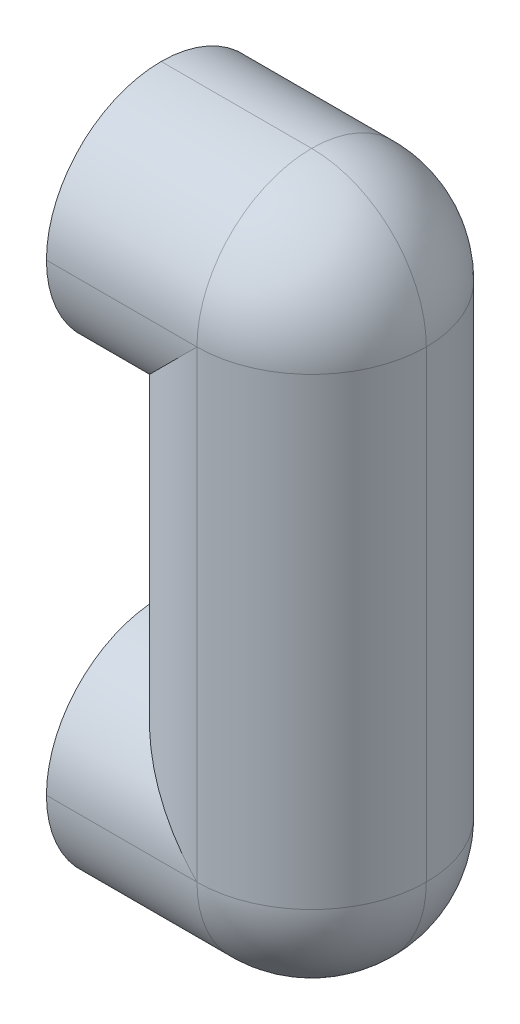
ISO-10303-21;
HEADER;
FILE_DESCRIPTION(('STEP AP214'),'2;1');
FILE_NAME('part.step','',(''),(''),'','','');
FILE_SCHEMA(('AUTOMOTIVE_DESIGN { 1 0 10303 214 1 1 1 1 }'));
ENDSEC;
DATA;
#1=APPLICATION_CONTEXT('core data for automotive mechanical design processes');
#2=APPLICATION_PROTOCOL_DEFINITION('international standard','automotive_design',2000,#1);
#3=PRODUCT_CONTEXT('',#1,'mechanical');
#4=PRODUCT('Part','Part','',(#3));
#5=PRODUCT_RELATED_PRODUCT_CATEGORY('part','',(#4));
#6=PRODUCT_DEFINITION_FORMATION('','',#4);
#7=PRODUCT_DEFINITION_CONTEXT('part definition',#1,'design');
#8=PRODUCT_DEFINITION('design','',#6,#7);
#9=PRODUCT_DEFINITION_SHAPE('','',#8);
#10=(LENGTH_UNIT() NAMED_UNIT(*) SI_UNIT(.MILLI.,.METRE.));
#11=(NAMED_UNIT(*) PLANE_ANGLE_UNIT() SI_UNIT($,.RADIAN.));
#12=(NAMED_UNIT(*) SI_UNIT($,.STERADIAN.) SOLID_ANGLE_UNIT());
#13=UNCERTAINTY_MEASURE_WITH_UNIT(LENGTH_MEASURE(1.E-05),#10,'distance_accuracy_value','');
#14=(GEOMETRIC_REPRESENTATION_CONTEXT(3) GLOBAL_UNCERTAINTY_ASSIGNED_CONTEXT((#13)) GLOBAL_UNIT_ASSIGNED_CONTEXT((#10,
#11,#12)) REPRESENTATION_CONTEXT('',''));
#15=CARTESIAN_POINT('',(0.,0.,0.));
#16=DIRECTION('',(0.,0.,1.));
#17=DIRECTION('',(1.,0.,0.));
#18=AXIS2_PLACEMENT_3D('',#15,#16,#17);
#19=CARTESIAN_POINT('',(-7.5,0.,0.));
#20=DIRECTION('',(-1.,0.,0.));
#21=DIRECTION('',(0.,0.,1.));
#22=AXIS2_PLACEMENT_3D('',#19,#20,#21);
#23=PLANE('',#22);
#24=CARTESIAN_POINT('',(-7.50000000000001,48.5,-24.));
#25=DIRECTION('',(-1.,0.,0.));
#26=DIRECTION('',(0.,0.,1.));
#27=AXIS2_PLACEMENT_3D('',#24,#25,#26);
#28=CIRCLE('',#27,5.);
#29=CARTESIAN_POINT('',(-7.50000000000001,48.5,-19.));
#30=VERTEX_POINT('',#29);
#31=EDGE_CURVE('E41',#30,#30,#28,.F.);
#32=ORIENTED_EDGE('',*,*,#31,.T.);
#33=EDGE_LOOP('',(#32));
#34=FACE_BOUND('',#33,.T.);
#35=CARTESIAN_POINT('',(-7.50000000000001,48.5,-24.));
#36=DIRECTION('',(-1.,0.,0.));
#37=DIRECTION('',(0.,0.,1.));
#38=AXIS2_PLACEMENT_3D('',#35,#36,#37);
#39=CIRCLE('',#38,24.);
#40=CARTESIAN_POINT('',(-7.50000000000001,48.5,-48.));
#41=VERTEX_POINT('',#40);
#42=CARTESIAN_POINT('',(-7.50000000000001,24.5,-24.));
#43=VERTEX_POINT('',#42);
#44=EDGE_CURVE('E47',#41,#43,#39,.T.);
#45=ORIENTED_EDGE('',*,*,#44,.T.);
#46=CARTESIAN_POINT('',(-7.50000000000001,48.5,-24.));
#47=DIRECTION('',(-1.,0.,0.));
#48=DIRECTION('',(0.,0.,1.));
#49=AXIS2_PLACEMENT_3D('',#46,#47,#48);
#50=CIRCLE('',#49,24.);
#51=CARTESIAN_POINT('',(-7.5,48.5,0.));
#52=VERTEX_POINT('',#51);
#53=EDGE_CURVE('E11',#43,#52,#50,.T.);
#54=ORIENTED_EDGE('',*,*,#53,.T.);
#55=CARTESIAN_POINT('',(-7.50000000000001,48.5,-24.));
#56=DIRECTION('',(-1.,0.,0.));
#57=DIRECTION('',(0.,0.,1.));
#58=AXIS2_PLACEMENT_3D('',#55,#56,#57);
#59=CIRCLE('',#58,24.);
#60=CARTESIAN_POINT('',(-7.50000000000001,72.5,-24.));
#61=VERTEX_POINT('',#60);
#62=EDGE_CURVE('E55',#52,#61,#59,.T.);
#63=ORIENTED_EDGE('',*,*,#62,.T.);
#64=CARTESIAN_POINT('',(-7.50000000000001,48.5,-24.));
#65=DIRECTION('',(-1.,0.,0.));
#66=DIRECTION('',(0.,0.,1.));
#67=AXIS2_PLACEMENT_3D('',#64,#65,#66);
#68=CIRCLE('',#67,24.);
#69=EDGE_CURVE('E119',#61,#41,#68,.T.);
#70=ORIENTED_EDGE('',*,*,#69,.T.);
#71=EDGE_LOOP('',(#45,#54,#63,#70));
#72=FACE_BOUND('',#71,.T.);
#73=ADVANCED_FACE('F37',(#34,#72),#23,.T.);
#74=CARTESIAN_POINT('',(-7.5,0.,0.));
#75=DIRECTION('',(1.,0.,0.));
#76=DIRECTION('',(0.,0.,-1.));
#77=AXIS2_PLACEMENT_3D('',#74,#75,#76);
#78=PLANE('',#77);
#79=CARTESIAN_POINT('',(-7.50000000000001,-48.5,-24.));
#80=DIRECTION('',(-1.,0.,0.));
#81=DIRECTION('',(0.,0.,1.));
#82=AXIS2_PLACEMENT_3D('',#79,#80,#81);
#83=CIRCLE('',#82,5.);
#84=CARTESIAN_POINT('',(-7.50000000000001,-48.5,-19.));
#85=VERTEX_POINT('',#84);
#86=EDGE_CURVE('E148',#85,#85,#83,.T.);
#87=ORIENTED_EDGE('',*,*,#86,.F.);
#88=EDGE_LOOP('',(#87));
#89=FACE_BOUND('',#88,.T.);
#90=CARTESIAN_POINT('',(-7.50000000000001,-48.5,-24.));
#91=DIRECTION('',(1.,0.,0.));
#92=DIRECTION('',(0.,0.,-1.));
#93=AXIS2_PLACEMENT_3D('',#90,#91,#92);
#94=CIRCLE('',#93,24.);
#95=CARTESIAN_POINT('',(-7.50000000000001,-72.5,-24.));
#96=VERTEX_POINT('',#95);
#97=CARTESIAN_POINT('',(-7.5,-48.5,0.));
#98=VERTEX_POINT('',#97);
#99=EDGE_CURVE('E140',#96,#98,#94,.F.);
#100=ORIENTED_EDGE('',*,*,#99,.T.);
#101=CARTESIAN_POINT('',(-7.50000000000001,-48.5,-24.));
#102=DIRECTION('',(1.,0.,0.));
#103=DIRECTION('',(0.,0.,-1.));
#104=AXIS2_PLACEMENT_3D('',#101,#102,#103);
#105=CIRCLE('',#104,24.);
#106=CARTESIAN_POINT('',(-7.50000000000001,-24.5,-24.));
#107=VERTEX_POINT('',#106);
#108=EDGE_CURVE('E152',#98,#107,#105,.F.);
#109=ORIENTED_EDGE('',*,*,#108,.T.);
#110=CARTESIAN_POINT('',(-7.50000000000001,-48.5,-24.));
#111=DIRECTION('',(1.,0.,0.));
#112=DIRECTION('',(0.,0.,-1.));
#113=AXIS2_PLACEMENT_3D('',#110,#111,#112);
#114=CIRCLE('',#113,24.);
#115=CARTESIAN_POINT('',(-7.50000000000001,-48.5,-48.));
#116=VERTEX_POINT('',#115);
#117=EDGE_CURVE('E106',#107,#116,#114,.F.);
#118=ORIENTED_EDGE('',*,*,#117,.T.);
#119=CARTESIAN_POINT('',(-7.50000000000001,-48.5,-24.));
#120=DIRECTION('',(1.,0.,0.));
#121=DIRECTION('',(0.,0.,-1.));
#122=AXIS2_PLACEMENT_3D('',#119,#120,#121);
#123=CIRCLE('',#122,24.);
#124=EDGE_CURVE('E142',#116,#96,#123,.F.);
#125=ORIENTED_EDGE('',*,*,#124,.T.);
#126=EDGE_LOOP('',(#100,#109,#118,#125));
#127=FACE_BOUND('',#126,.T.);
#128=ADVANCED_FACE('F238',(#89,#127),#78,.F.);
#129=CARTESIAN_POINT('',(0.,48.5,-24.));
#130=DIRECTION('',(1.,0.,0.));
#131=DIRECTION('',(0.,0.,-1.));
#132=AXIS2_PLACEMENT_3D('',#129,#130,#131);
#133=CYLINDRICAL_SURFACE('',#132,24.);
#134=DIRECTION('',(1.,0.,0.));
#135=VECTOR('',#134,1.);
#136=CARTESIAN_POINT('',(0.,48.5,0.));
#137=LINE('',#136,#135);
#138=CARTESIAN_POINT('',(24.,48.5,0.));
#139=VERTEX_POINT('',#138);
#140=EDGE_CURVE('E124',#52,#139,#137,.T.);
#141=ORIENTED_EDGE('',*,*,#140,.F.);
#142=ORIENTED_EDGE('',*,*,#53,.F.);
#143=DIRECTION('',(1.,0.,0.));
#144=VECTOR('',#143,1.);
#145=CARTESIAN_POINT('',(-7.50000000000001,24.5,-24.));
#146=LINE('',#145,#144);
#147=CARTESIAN_POINT('',(0.,24.5,-24.));
#148=VERTEX_POINT('',#147);
#149=EDGE_CURVE('E90',#148,#43,#146,.F.);
#150=ORIENTED_EDGE('',*,*,#149,.F.);
#151=CARTESIAN_POINT('',(24.,48.5,-24.));
#152=DIRECTION('',(0.707106781186547,-0.707106781186547,0.));
#153=DIRECTION('',(0.707106781186547,0.707106781186547,0.));
#154=AXIS2_PLACEMENT_3D('',#151,#152,#153);
#155=ELLIPSE('',#154,33.9411254969543,24.);
#156=EDGE_CURVE('E135',#139,#148,#155,.T.);
#157=ORIENTED_EDGE('',*,*,#156,.F.);
#158=EDGE_LOOP('',(#141,#142,#150,#157));
#159=FACE_BOUND('',#158,.T.);
#160=ADVANCED_FACE('F39',(#159),#133,.T.);
#161=CARTESIAN_POINT('',(0.,48.5,-24.));
#162=DIRECTION('',(1.,0.,0.));
#163=DIRECTION('',(0.,0.,-1.));
#164=AXIS2_PLACEMENT_3D('',#161,#162,#163);
#165=CYLINDRICAL_SURFACE('',#164,24.);
#166=CARTESIAN_POINT('',(24.,48.5,-24.));
#167=DIRECTION('',(1.,0.,0.));
#168=DIRECTION('',(0.,0.,-1.));
#169=AXIS2_PLACEMENT_3D('',#166,#167,#168);
#170=CIRCLE('',#169,24.);
#171=CARTESIAN_POINT('',(24.,72.5,-24.));
#172=VERTEX_POINT('',#171);
#173=EDGE_CURVE('E207',#172,#139,#170,.T.);
#174=ORIENTED_EDGE('',*,*,#173,.F.);
#175=DIRECTION('',(1.,0.,0.));
#176=VECTOR('',#175,1.);
#177=CARTESIAN_POINT('',(0.,72.5,-24.));
#178=LINE('',#177,#176);
#179=EDGE_CURVE('E133',#61,#172,#178,.T.);
#180=ORIENTED_EDGE('',*,*,#179,.F.);
#181=ORIENTED_EDGE('',*,*,#62,.F.);
#182=ORIENTED_EDGE('',*,*,#140,.T.);
#183=EDGE_LOOP('',(#174,#180,#181,#182));
#184=FACE_BOUND('',#183,.T.);
#185=ADVANCED_FACE('F215',(#184),#165,.T.);
#186=CARTESIAN_POINT('',(0.,48.5,-24.));
#187=DIRECTION('',(-1.,0.,0.));
#188=DIRECTION('',(0.,0.,1.));
#189=AXIS2_PLACEMENT_3D('',#186,#187,#188);
#190=CYLINDRICAL_SURFACE('',#189,24.);
#191=DIRECTION('',(-1.,0.,0.));
#192=VECTOR('',#191,1.);
#193=CARTESIAN_POINT('',(0.,48.5,-48.));
#194=LINE('',#193,#192);
#195=CARTESIAN_POINT('',(24.,48.5,-48.));
#196=VERTEX_POINT('',#195);
#197=EDGE_CURVE('E130',#41,#196,#194,.F.);
#198=ORIENTED_EDGE('',*,*,#197,.F.);
#199=ORIENTED_EDGE('',*,*,#69,.F.);
#200=ORIENTED_EDGE('',*,*,#179,.T.);
#201=CARTESIAN_POINT('',(24.,48.5,-24.));
#202=DIRECTION('',(1.,0.,0.));
#203=DIRECTION('',(0.,0.,-1.));
#204=AXIS2_PLACEMENT_3D('',#201,#202,#203);
#205=CIRCLE('',#204,24.);
#206=EDGE_CURVE('E203',#196,#172,#205,.T.);
#207=ORIENTED_EDGE('',*,*,#206,.F.);
#208=EDGE_LOOP('',(#198,#199,#200,#207));
#209=FACE_BOUND('',#208,.T.);
#210=ADVANCED_FACE('F218',(#209),#190,.T.);
#211=CARTESIAN_POINT('',(-7.50000000000001,-48.5,-24.));
#212=DIRECTION('',(1.,0.,0.));
#213=DIRECTION('',(0.,0.,-1.));
#214=AXIS2_PLACEMENT_3D('',#211,#212,#213);
#215=CYLINDRICAL_SURFACE('',#214,24.);
#216=CARTESIAN_POINT('',(24.,-48.5,-24.));
#217=DIRECTION('',(0.707106781186547,0.707106781186547,0.));
#218=DIRECTION('',(0.707106781186547,-0.707106781186547,0.));
#219=AXIS2_PLACEMENT_3D('',#216,#217,#218);
#220=ELLIPSE('',#219,33.9411254969543,24.);
#221=CARTESIAN_POINT('',(0.,-24.5,-24.));
#222=VERTEX_POINT('',#221);
#223=CARTESIAN_POINT('',(24.,-48.5,0.));
#224=VERTEX_POINT('',#223);
#225=EDGE_CURVE('E131',#222,#224,#220,.T.);
#226=ORIENTED_EDGE('',*,*,#225,.F.);
#227=DIRECTION('',(1.,0.,0.));
#228=VECTOR('',#227,1.);
#229=CARTESIAN_POINT('',(-7.50000000000001,-24.5,-24.));
#230=LINE('',#229,#228);
#231=EDGE_CURVE('E195',#107,#222,#230,.T.);
#232=ORIENTED_EDGE('',*,*,#231,.F.);
#233=ORIENTED_EDGE('',*,*,#108,.F.);
#234=DIRECTION('',(1.,0.,0.));
#235=VECTOR('',#234,1.);
#236=CARTESIAN_POINT('',(0.,-48.5,0.));
#237=LINE('',#236,#235);
#238=EDGE_CURVE('E192',#224,#98,#237,.F.);
#239=ORIENTED_EDGE('',*,*,#238,.F.);
#240=EDGE_LOOP('',(#226,#232,#233,#239));
#241=FACE_BOUND('',#240,.T.);
#242=ADVANCED_FACE('F236',(#241),#215,.T.);
#243=CARTESIAN_POINT('',(-7.50000000000001,48.5,-24.));
#244=DIRECTION('',(1.,0.,0.));
#245=DIRECTION('',(0.,0.,-1.));
#246=AXIS2_PLACEMENT_3D('',#243,#244,#245);
#247=CYLINDRICAL_SURFACE('',#246,24.);
#248=ORIENTED_EDGE('',*,*,#44,.F.);
#249=ORIENTED_EDGE('',*,*,#197,.T.);
#250=CARTESIAN_POINT('',(24.,48.5,-24.));
#251=DIRECTION('',(0.707106781186547,-0.707106781186547,0.));
#252=DIRECTION('',(-0.707106781186547,-0.707106781186547,0.));
#253=AXIS2_PLACEMENT_3D('',#250,#251,#252);
#254=ELLIPSE('',#253,33.9411254969543,24.);
#255=EDGE_CURVE('E128',#148,#196,#254,.T.);
#256=ORIENTED_EDGE('',*,*,#255,.F.);
#257=ORIENTED_EDGE('',*,*,#149,.T.);
#258=EDGE_LOOP('',(#248,#249,#256,#257));
#259=FACE_BOUND('',#258,.T.);
#260=ADVANCED_FACE('F126',(#259),#247,.T.);
#261=CARTESIAN_POINT('',(24.,72.5,-24.));
#262=DIRECTION('',(0.,-1.,0.));
#263=DIRECTION('',(0.,0.,-1.));
#264=AXIS2_PLACEMENT_3D('',#261,#262,#263);
#265=CYLINDRICAL_SURFACE('',#264,24.);
#266=DIRECTION('',(0.,-1.,0.));
#267=VECTOR('',#266,1.);
#268=CARTESIAN_POINT('',(24.,72.5,0.));
#269=LINE('',#268,#267);
#270=EDGE_CURVE('E189',#139,#224,#269,.T.);
#271=ORIENTED_EDGE('',*,*,#270,.F.);
#272=ORIENTED_EDGE('',*,*,#156,.T.);
#273=DIRECTION('',(0.,-1.,0.));
#274=VECTOR('',#273,1.);
#275=CARTESIAN_POINT('',(0.,72.5,-24.));
#276=LINE('',#275,#274);
#277=EDGE_CURVE('E200',#222,#148,#276,.F.);
#278=ORIENTED_EDGE('',*,*,#277,.F.);
#279=ORIENTED_EDGE('',*,*,#225,.T.);
#280=EDGE_LOOP('',(#271,#272,#278,#279));
#281=FACE_BOUND('',#280,.T.);
#282=ADVANCED_FACE('F211',(#281),#265,.T.);
#283=CARTESIAN_POINT('',(24.,48.5,-24.));
#284=DIRECTION('',(0.,1.,0.));
#285=DIRECTION('',(0.,0.,1.));
#286=AXIS2_PLACEMENT_3D('',#283,#284,#285);
#287=SPHERICAL_SURFACE('',#286,24.);
#288=CARTESIAN_POINT('',(24.,48.5,-24.));
#289=DIRECTION('',(0.,0.,1.));
#290=DIRECTION('',(1.,0.,0.));
#291=AXIS2_PLACEMENT_3D('',#288,#289,#290);
#292=CIRCLE('',#291,24.);
#293=CARTESIAN_POINT('',(48.,48.5,-24.));
#294=VERTEX_POINT('',#293);
#295=EDGE_CURVE('E97',#294,#172,#292,.T.);
#296=ORIENTED_EDGE('',*,*,#295,.T.);
#297=ORIENTED_EDGE('',*,*,#173,.T.);
#298=CARTESIAN_POINT('',(24.,48.5,-24.));
#299=DIRECTION('',(0.,1.,0.));
#300=DIRECTION('',(0.,0.,1.));
#301=AXIS2_PLACEMENT_3D('',#298,#299,#300);
#302=CIRCLE('',#301,24.);
#303=EDGE_CURVE('E186',#294,#139,#302,.F.);
#304=ORIENTED_EDGE('',*,*,#303,.F.);
#305=EDGE_LOOP('',(#296,#297,#304));
#306=FACE_BOUND('',#305,.T.);
#307=ADVANCED_FACE('F213',(#306),#287,.T.);
#308=CARTESIAN_POINT('',(24.,48.5,-24.));
#309=DIRECTION('',(0.,1.,0.));
#310=DIRECTION('',(0.,0.,1.));
#311=AXIS2_PLACEMENT_3D('',#308,#309,#310);
#312=SPHERICAL_SURFACE('',#311,24.);
#313=ORIENTED_EDGE('',*,*,#206,.T.);
#314=ORIENTED_EDGE('',*,*,#295,.F.);
#315=CARTESIAN_POINT('',(24.,48.5,-24.));
#316=DIRECTION('',(0.,1.,0.));
#317=DIRECTION('',(0.,0.,1.));
#318=AXIS2_PLACEMENT_3D('',#315,#316,#317);
#319=CIRCLE('',#318,24.);
#320=EDGE_CURVE('E181',#196,#294,#319,.F.);
#321=ORIENTED_EDGE('',*,*,#320,.F.);
#322=EDGE_LOOP('',(#313,#314,#321));
#323=FACE_BOUND('',#322,.T.);
#324=ADVANCED_FACE('F221',(#323),#312,.T.);
#325=CARTESIAN_POINT('',(24.,72.5,-24.));
#326=DIRECTION('',(0.,-1.,0.));
#327=DIRECTION('',(0.,0.,-1.));
#328=AXIS2_PLACEMENT_3D('',#325,#326,#327);
#329=CYLINDRICAL_SURFACE('',#328,24.);
#330=CARTESIAN_POINT('',(24.,-48.5,-24.));
#331=DIRECTION('',(0.707106781186547,0.707106781186547,0.));
#332=DIRECTION('',(0.707106781186547,-0.707106781186547,0.));
#333=AXIS2_PLACEMENT_3D('',#330,#331,#332);
#334=ELLIPSE('',#333,33.9411254969543,24.);
#335=CARTESIAN_POINT('',(24.,-48.5,-48.));
#336=VERTEX_POINT('',#335);
#337=EDGE_CURVE('E198',#222,#336,#334,.F.);
#338=ORIENTED_EDGE('',*,*,#337,.F.);
#339=ORIENTED_EDGE('',*,*,#277,.T.);
#340=ORIENTED_EDGE('',*,*,#255,.T.);
#341=DIRECTION('',(0.,-1.,0.));
#342=VECTOR('',#341,1.);
#343=CARTESIAN_POINT('',(24.,72.5,-48.));
#344=LINE('',#343,#342);
#345=EDGE_CURVE('E178',#336,#196,#344,.F.);
#346=ORIENTED_EDGE('',*,*,#345,.F.);
#347=EDGE_LOOP('',(#338,#339,#340,#346));
#348=FACE_BOUND('',#347,.T.);
#349=ADVANCED_FACE('F227',(#348),#329,.T.);
#350=CARTESIAN_POINT('',(0.,-48.5,-24.));
#351=DIRECTION('',(1.,0.,0.));
#352=DIRECTION('',(0.,0.,-1.));
#353=AXIS2_PLACEMENT_3D('',#350,#351,#352);
#354=CYLINDRICAL_SURFACE('',#353,24.);
#355=ORIENTED_EDGE('',*,*,#231,.T.);
#356=ORIENTED_EDGE('',*,*,#337,.T.);
#357=DIRECTION('',(1.,0.,0.));
#358=VECTOR('',#357,1.);
#359=CARTESIAN_POINT('',(0.,-48.5,-48.));
#360=LINE('',#359,#358);
#361=EDGE_CURVE('E175',#116,#336,#360,.T.);
#362=ORIENTED_EDGE('',*,*,#361,.F.);
#363=ORIENTED_EDGE('',*,*,#117,.F.);
#364=EDGE_LOOP('',(#355,#356,#362,#363));
#365=FACE_BOUND('',#364,.T.);
#366=ADVANCED_FACE('F233',(#365),#354,.T.);
#367=CARTESIAN_POINT('',(0.,-48.5,-24.));
#368=DIRECTION('',(-1.,0.,0.));
#369=DIRECTION('',(0.,0.,1.));
#370=AXIS2_PLACEMENT_3D('',#367,#368,#369);
#371=CYLINDRICAL_SURFACE('',#370,24.);
#372=ORIENTED_EDGE('',*,*,#238,.T.);
#373=ORIENTED_EDGE('',*,*,#99,.F.);
#374=DIRECTION('',(1.,0.,0.));
#375=VECTOR('',#374,1.);
#376=CARTESIAN_POINT('',(-7.5,-72.5,-24.));
#377=LINE('',#376,#375);
#378=CARTESIAN_POINT('',(24.,-72.5,-24.));
#379=VERTEX_POINT('',#378);
#380=EDGE_CURVE('E172',#379,#96,#377,.F.);
#381=ORIENTED_EDGE('',*,*,#380,.F.);
#382=CARTESIAN_POINT('',(24.,-48.5,-24.));
#383=DIRECTION('',(1.,0.,0.));
#384=DIRECTION('',(0.,0.,-1.));
#385=AXIS2_PLACEMENT_3D('',#382,#383,#384);
#386=CIRCLE('',#385,24.);
#387=EDGE_CURVE('E169',#224,#379,#386,.T.);
#388=ORIENTED_EDGE('',*,*,#387,.F.);
#389=EDGE_LOOP('',(#372,#373,#381,#388));
#390=FACE_BOUND('',#389,.T.);
#391=ADVANCED_FACE('F268',(#390),#371,.T.);
#392=CARTESIAN_POINT('',(24.,72.5,-24.));
#393=DIRECTION('',(0.,-1.,0.));
#394=DIRECTION('',(0.,0.,-1.));
#395=AXIS2_PLACEMENT_3D('',#392,#393,#394);
#396=CYLINDRICAL_SURFACE('',#395,24.);
#397=DIRECTION('',(0.,-1.,0.));
#398=VECTOR('',#397,1.);
#399=CARTESIAN_POINT('',(48.,72.5,-24.));
#400=LINE('',#399,#398);
#401=CARTESIAN_POINT('',(48.,-48.5,-24.));
#402=VERTEX_POINT('',#401);
#403=EDGE_CURVE('E184',#294,#402,#400,.T.);
#404=ORIENTED_EDGE('',*,*,#403,.F.);
#405=ORIENTED_EDGE('',*,*,#303,.T.);
#406=ORIENTED_EDGE('',*,*,#270,.T.);
#407=CARTESIAN_POINT('',(24.,-48.5,-24.));
#408=DIRECTION('',(0.,-1.,0.));
#409=DIRECTION('',(0.,0.,-1.));
#410=AXIS2_PLACEMENT_3D('',#407,#408,#409);
#411=CIRCLE('',#410,24.);
#412=EDGE_CURVE('E166',#402,#224,#411,.T.);
#413=ORIENTED_EDGE('',*,*,#412,.F.);
#414=EDGE_LOOP('',(#404,#405,#406,#413));
#415=FACE_BOUND('',#414,.T.);
#416=ADVANCED_FACE('F265',(#415),#396,.T.);
#417=CARTESIAN_POINT('',(24.,72.5,-24.));
#418=DIRECTION('',(0.,-1.,0.));
#419=DIRECTION('',(0.,0.,-1.));
#420=AXIS2_PLACEMENT_3D('',#417,#418,#419);
#421=CYLINDRICAL_SURFACE('',#420,24.);
#422=ORIENTED_EDGE('',*,*,#320,.T.);
#423=ORIENTED_EDGE('',*,*,#403,.T.);
#424=CARTESIAN_POINT('',(24.,-48.5,-24.));
#425=DIRECTION('',(0.,-1.,0.));
#426=DIRECTION('',(0.,0.,-1.));
#427=AXIS2_PLACEMENT_3D('',#424,#425,#426);
#428=CIRCLE('',#427,24.);
#429=EDGE_CURVE('E163',#336,#402,#428,.T.);
#430=ORIENTED_EDGE('',*,*,#429,.F.);
#431=ORIENTED_EDGE('',*,*,#345,.T.);
#432=EDGE_LOOP('',(#422,#423,#430,#431));
#433=FACE_BOUND('',#432,.T.);
#434=ADVANCED_FACE('F225',(#433),#421,.T.);
#435=CARTESIAN_POINT('',(0.,-48.5,-24.));
#436=DIRECTION('',(1.,0.,0.));
#437=DIRECTION('',(0.,0.,-1.));
#438=AXIS2_PLACEMENT_3D('',#435,#436,#437);
#439=CYLINDRICAL_SURFACE('',#438,24.);
#440=ORIENTED_EDGE('',*,*,#124,.F.);
#441=ORIENTED_EDGE('',*,*,#361,.T.);
#442=CARTESIAN_POINT('',(24.,-48.5,-24.));
#443=DIRECTION('',(1.,0.,0.));
#444=DIRECTION('',(0.,0.,-1.));
#445=AXIS2_PLACEMENT_3D('',#442,#443,#444);
#446=CIRCLE('',#445,24.);
#447=EDGE_CURVE('E159',#379,#336,#446,.T.);
#448=ORIENTED_EDGE('',*,*,#447,.F.);
#449=ORIENTED_EDGE('',*,*,#380,.T.);
#450=EDGE_LOOP('',(#440,#441,#448,#449));
#451=FACE_BOUND('',#450,.T.);
#452=ADVANCED_FACE('F231',(#451),#439,.T.);
#453=CARTESIAN_POINT('',(24.,-48.5,-24.));
#454=DIRECTION('',(0.,0.,1.));
#455=DIRECTION('',(0.,-1.,0.));
#456=AXIS2_PLACEMENT_3D('',#453,#454,#455);
#457=SPHERICAL_SURFACE('',#456,24.);
#458=ORIENTED_EDGE('',*,*,#412,.T.);
#459=ORIENTED_EDGE('',*,*,#387,.T.);
#460=CARTESIAN_POINT('',(24.,-48.5,-24.));
#461=DIRECTION('',(0.,0.,1.));
#462=DIRECTION('',(1.,0.,0.));
#463=AXIS2_PLACEMENT_3D('',#460,#461,#462);
#464=CIRCLE('',#463,24.);
#465=EDGE_CURVE('E156',#402,#379,#464,.F.);
#466=ORIENTED_EDGE('',*,*,#465,.F.);
#467=EDGE_LOOP('',(#458,#459,#466));
#468=FACE_BOUND('',#467,.T.);
#469=ADVANCED_FACE('F256',(#468),#457,.T.);
#470=CARTESIAN_POINT('',(24.,-48.5,-24.));
#471=DIRECTION('',(0.,0.,-1.));
#472=DIRECTION('',(0.,1.,0.));
#473=AXIS2_PLACEMENT_3D('',#470,#471,#472);
#474=SPHERICAL_SURFACE('',#473,24.);
#475=ORIENTED_EDGE('',*,*,#447,.T.);
#476=ORIENTED_EDGE('',*,*,#429,.T.);
#477=ORIENTED_EDGE('',*,*,#465,.T.);
#478=EDGE_LOOP('',(#475,#476,#477));
#479=FACE_BOUND('',#478,.T.);
#480=ADVANCED_FACE('F253',(#479),#474,.T.);
#481=CARTESIAN_POINT('',(7.49999999999999,-48.5,-24.));
#482=DIRECTION('',(-1.,0.,0.));
#483=DIRECTION('',(0.,0.,1.));
#484=AXIS2_PLACEMENT_3D('',#481,#482,#483);
#485=CYLINDRICAL_SURFACE('',#484,5.);
#486=CARTESIAN_POINT('',(7.49999999999999,-48.5,-24.));
#487=DIRECTION('',(-1.,0.,0.));
#488=DIRECTION('',(0.,0.,1.));
#489=AXIS2_PLACEMENT_3D('',#486,#487,#488);
#490=CIRCLE('',#489,5.);
#491=CARTESIAN_POINT('',(7.49999999999999,-48.5,-19.));
#492=VERTEX_POINT('',#491);
#493=EDGE_CURVE('E160',#492,#492,#490,.T.);
#494=ORIENTED_EDGE('',*,*,#493,.F.);
#495=EDGE_LOOP('',(#494));
#496=FACE_BOUND('',#495,.T.);
#497=ORIENTED_EDGE('',*,*,#86,.T.);
#498=EDGE_LOOP('',(#497));
#499=FACE_BOUND('',#498,.T.);
#500=ADVANCED_FACE('F250',(#496,#499),#485,.F.);
#501=CARTESIAN_POINT('',(7.49999999999999,-48.5,-24.));
#502=DIRECTION('',(-1.,0.,0.));
#503=DIRECTION('',(0.,0.,1.));
#504=AXIS2_PLACEMENT_3D('',#501,#502,#503);
#505=PLANE('',#504);
#506=ORIENTED_EDGE('',*,*,#493,.T.);
#507=EDGE_LOOP('',(#506));
#508=FACE_BOUND('',#507,.T.);
#509=ADVANCED_FACE('F355',(#508),#505,.T.);
#510=CARTESIAN_POINT('',(-15.,48.5,-24.));
#511=DIRECTION('',(1.,0.,0.));
#512=DIRECTION('',(0.,0.,-1.));
#513=AXIS2_PLACEMENT_3D('',#510,#511,#512);
#514=CYLINDRICAL_SURFACE('',#513,5.);
#515=ORIENTED_EDGE('',*,*,#31,.F.);
#516=EDGE_LOOP('',(#515));
#517=FACE_BOUND('',#516,.T.);
#518=CARTESIAN_POINT('',(-15.,48.5,-24.));
#519=DIRECTION('',(-1.,0.,0.));
#520=DIRECTION('',(0.,0.,1.));
#521=AXIS2_PLACEMENT_3D('',#518,#519,#520);
#522=CIRCLE('',#521,5.);
#523=CARTESIAN_POINT('',(-15.,48.5,-19.));
#524=VERTEX_POINT('',#523);
#525=EDGE_CURVE('E478',#524,#524,#522,.T.);
#526=ORIENTED_EDGE('',*,*,#525,.F.);
#527=EDGE_LOOP('',(#526));
#528=FACE_BOUND('',#527,.T.);
#529=ADVANCED_FACE('F362',(#517,#528),#514,.T.);
#530=CARTESIAN_POINT('',(-15.,48.5,-24.));
#531=DIRECTION('',(-1.,0.,0.));
#532=DIRECTION('',(0.,0.,1.));
#533=AXIS2_PLACEMENT_3D('',#530,#531,#532);
#534=PLANE('',#533);
#535=ORIENTED_EDGE('',*,*,#525,.T.);
#536=EDGE_LOOP('',(#535));
#537=FACE_BOUND('',#536,.T.);
#538=ADVANCED_FACE('F370',(#537),#534,.T.);
#539=CLOSED_SHELL('',(#73,#128,#160,#185,#210,#242,#260,#282,#307,#324,#349,#366,#391,#416,#434,
#452,#469,#480,#500,#509,#529,#538));
#540=MANIFOLD_SOLID_BREP('B2',#539);
#541=ADVANCED_BREP_SHAPE_REPRESENTATION('',(#18,#540),#14);
#542=SHAPE_DEFINITION_REPRESENTATION(#9,#541);
ENDSEC;
END-ISO-10303-21;
